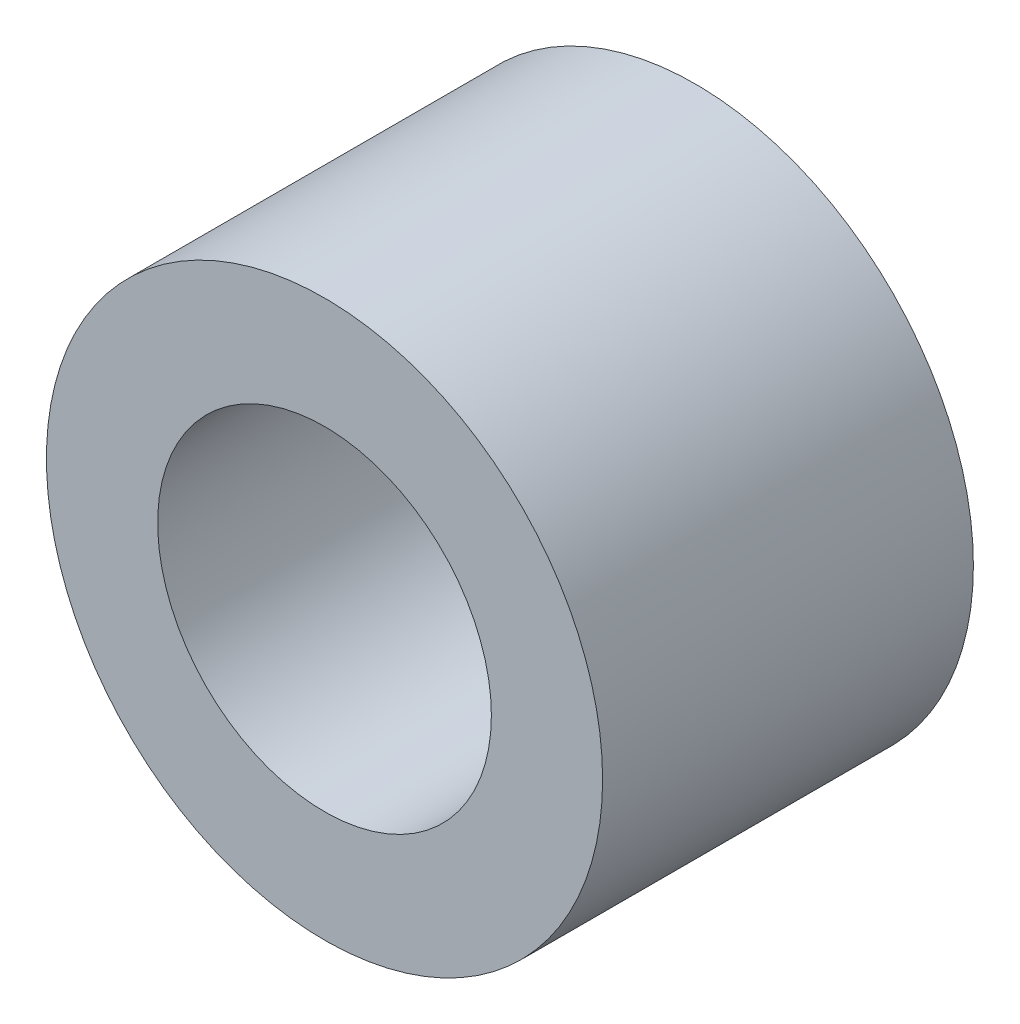
ISO-10303-21;
HEADER;
FILE_DESCRIPTION(('STEP AP214'),'2;1');
FILE_NAME('part.step','',(''),(''),'','','');
FILE_SCHEMA(('AUTOMOTIVE_DESIGN { 1 0 10303 214 1 1 1 1 }'));
ENDSEC;
DATA;
#1=APPLICATION_CONTEXT('core data for automotive mechanical design processes');
#2=APPLICATION_PROTOCOL_DEFINITION('international standard','automotive_design',2000,#1);
#3=PRODUCT_CONTEXT('',#1,'mechanical');
#4=PRODUCT('Part','Part','',(#3));
#5=PRODUCT_RELATED_PRODUCT_CATEGORY('part','',(#4));
#6=PRODUCT_DEFINITION_FORMATION('','',#4);
#7=PRODUCT_DEFINITION_CONTEXT('part definition',#1,'design');
#8=PRODUCT_DEFINITION('design','',#6,#7);
#9=PRODUCT_DEFINITION_SHAPE('','',#8);
#10=(LENGTH_UNIT() NAMED_UNIT(*) SI_UNIT(.MILLI.,.METRE.));
#11=(NAMED_UNIT(*) PLANE_ANGLE_UNIT() SI_UNIT($,.RADIAN.));
#12=(NAMED_UNIT(*) SI_UNIT($,.STERADIAN.) SOLID_ANGLE_UNIT());
#13=UNCERTAINTY_MEASURE_WITH_UNIT(LENGTH_MEASURE(1.E-05),#10,'distance_accuracy_value','');
#14=(GEOMETRIC_REPRESENTATION_CONTEXT(3) GLOBAL_UNCERTAINTY_ASSIGNED_CONTEXT((#13)) GLOBAL_UNIT_ASSIGNED_CONTEXT((#10,
#11,#12)) REPRESENTATION_CONTEXT('',''));
#15=CARTESIAN_POINT('',(0.,0.,0.));
#16=DIRECTION('',(0.,0.,1.));
#17=DIRECTION('',(1.,0.,0.));
#18=AXIS2_PLACEMENT_3D('',#15,#16,#17);
#19=CARTESIAN_POINT('',(0.,0.,1.5));
#20=DIRECTION('',(0.,0.,1.));
#21=DIRECTION('',(1.,0.,0.));
#22=AXIS2_PLACEMENT_3D('',#19,#20,#21);
#23=PLANE('',#22);
#24=CARTESIAN_POINT('',(0.,0.,1.5));
#25=DIRECTION('',(0.,0.,1.));
#26=DIRECTION('',(1.,0.,0.));
#27=AXIS2_PLACEMENT_3D('',#24,#25,#26);
#28=CIRCLE('',#27,2.25);
#29=CARTESIAN_POINT('',(2.25,0.,1.5));
#30=VERTEX_POINT('',#29);
#31=EDGE_CURVE('E10',#30,#30,#28,.T.);
#32=ORIENTED_EDGE('',*,*,#31,.T.);
#33=EDGE_LOOP('',(#32));
#34=FACE_BOUND('',#33,.T.);
#35=CARTESIAN_POINT('',(0.,0.,1.5));
#36=DIRECTION('',(0.,0.,1.));
#37=DIRECTION('',(1.,0.,0.));
#38=AXIS2_PLACEMENT_3D('',#35,#36,#37);
#39=CIRCLE('',#38,1.35);
#40=CARTESIAN_POINT('',(1.35,0.,1.5));
#41=VERTEX_POINT('',#40);
#42=EDGE_CURVE('E40',#41,#41,#39,.T.);
#43=ORIENTED_EDGE('',*,*,#42,.F.);
#44=EDGE_LOOP('',(#43));
#45=FACE_BOUND('',#44,.T.);
#46=ADVANCED_FACE('F29',(#34,#45),#23,.T.);
#47=CARTESIAN_POINT('',(0.,0.,-1.5));
#48=DIRECTION('',(0.,0.,1.));
#49=DIRECTION('',(1.,0.,0.));
#50=AXIS2_PLACEMENT_3D('',#47,#48,#49);
#51=PLANE('',#50);
#52=CARTESIAN_POINT('',(0.,0.,-1.5));
#53=DIRECTION('',(0.,0.,1.));
#54=DIRECTION('',(1.,0.,0.));
#55=AXIS2_PLACEMENT_3D('',#52,#53,#54);
#56=CIRCLE('',#55,2.25);
#57=CARTESIAN_POINT('',(2.25,0.,-1.5));
#58=VERTEX_POINT('',#57);
#59=EDGE_CURVE('E33',#58,#58,#56,.T.);
#60=ORIENTED_EDGE('',*,*,#59,.F.);
#61=EDGE_LOOP('',(#60));
#62=FACE_BOUND('',#61,.T.);
#63=CARTESIAN_POINT('',(0.,0.,-1.5));
#64=DIRECTION('',(0.,0.,1.));
#65=DIRECTION('',(1.,0.,0.));
#66=AXIS2_PLACEMENT_3D('',#63,#64,#65);
#67=CIRCLE('',#66,1.35);
#68=CARTESIAN_POINT('',(1.35,0.,-1.5));
#69=VERTEX_POINT('',#68);
#70=EDGE_CURVE('E42',#69,#69,#67,.T.);
#71=ORIENTED_EDGE('',*,*,#70,.T.);
#72=EDGE_LOOP('',(#71));
#73=FACE_BOUND('',#72,.T.);
#74=ADVANCED_FACE('F52',(#62,#73),#51,.F.);
#75=CARTESIAN_POINT('',(0.,0.,1.5));
#76=DIRECTION('',(0.,0.,-1.));
#77=DIRECTION('',(-1.,0.,0.));
#78=AXIS2_PLACEMENT_3D('',#75,#76,#77);
#79=CYLINDRICAL_SURFACE('',#78,2.25);
#80=ORIENTED_EDGE('',*,*,#31,.F.);
#81=EDGE_LOOP('',(#80));
#82=FACE_BOUND('',#81,.T.);
#83=ORIENTED_EDGE('',*,*,#59,.T.);
#84=EDGE_LOOP('',(#83));
#85=FACE_BOUND('',#84,.T.);
#86=ADVANCED_FACE('F31',(#82,#85),#79,.T.);
#87=CARTESIAN_POINT('',(0.,0.,1.5));
#88=DIRECTION('',(0.,0.,-1.));
#89=DIRECTION('',(-1.,0.,0.));
#90=AXIS2_PLACEMENT_3D('',#87,#88,#89);
#91=CYLINDRICAL_SURFACE('',#90,1.35);
#92=ORIENTED_EDGE('',*,*,#42,.T.);
#93=EDGE_LOOP('',(#92));
#94=FACE_BOUND('',#93,.T.);
#95=ORIENTED_EDGE('',*,*,#70,.F.);
#96=EDGE_LOOP('',(#95));
#97=FACE_BOUND('',#96,.T.);
#98=ADVANCED_FACE('F48',(#94,#97),#91,.F.);
#99=CLOSED_SHELL('',(#46,#74,#86,#98));
#100=MANIFOLD_SOLID_BREP('B2',#99);
#101=ADVANCED_BREP_SHAPE_REPRESENTATION('',(#18,#100),#14);
#102=SHAPE_DEFINITION_REPRESENTATION(#9,#101);
ENDSEC;
END-ISO-10303-21;
